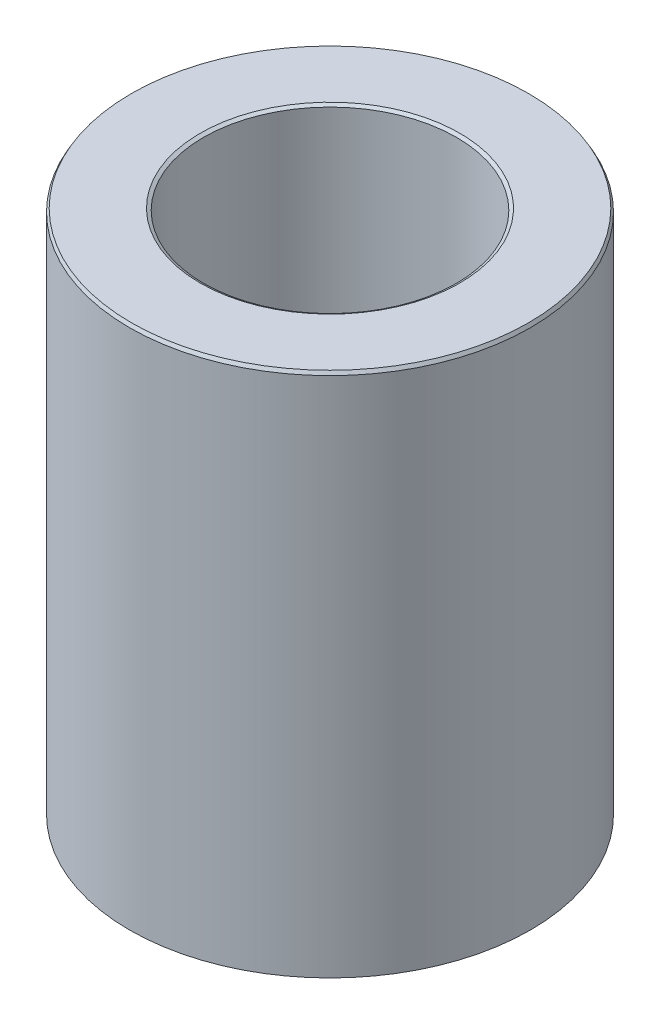
ISO-10303-21;
HEADER;
FILE_DESCRIPTION(('STEP AP214'),'2;1');
FILE_NAME('part.step','',(''),(''),'','','');
FILE_SCHEMA(('AUTOMOTIVE_DESIGN { 1 0 10303 214 1 1 1 1 }'));
ENDSEC;
DATA;
#1=APPLICATION_CONTEXT('core data for automotive mechanical design processes');
#2=APPLICATION_PROTOCOL_DEFINITION('international standard','automotive_design',2000,#1);
#3=PRODUCT_CONTEXT('',#1,'mechanical');
#4=PRODUCT('Part','Part','',(#3));
#5=PRODUCT_RELATED_PRODUCT_CATEGORY('part','',(#4));
#6=PRODUCT_DEFINITION_FORMATION('','',#4);
#7=PRODUCT_DEFINITION_CONTEXT('part definition',#1,'design');
#8=PRODUCT_DEFINITION('design','',#6,#7);
#9=PRODUCT_DEFINITION_SHAPE('','',#8);
#10=(LENGTH_UNIT() NAMED_UNIT(*) SI_UNIT(.MILLI.,.METRE.));
#11=(NAMED_UNIT(*) PLANE_ANGLE_UNIT() SI_UNIT($,.RADIAN.));
#12=(NAMED_UNIT(*) SI_UNIT($,.STERADIAN.) SOLID_ANGLE_UNIT());
#13=UNCERTAINTY_MEASURE_WITH_UNIT(LENGTH_MEASURE(1.E-05),#10,'distance_accuracy_value','');
#14=(GEOMETRIC_REPRESENTATION_CONTEXT(3) GLOBAL_UNCERTAINTY_ASSIGNED_CONTEXT((#13)) GLOBAL_UNIT_ASSIGNED_CONTEXT((#10,
#11,#12)) REPRESENTATION_CONTEXT('',''));
#15=CARTESIAN_POINT('',(0.,0.,0.));
#16=DIRECTION('',(0.,0.,1.));
#17=DIRECTION('',(1.,0.,0.));
#18=AXIS2_PLACEMENT_3D('',#15,#16,#17);
#19=CARTESIAN_POINT('',(0.,39.4217318701252,0.));
#20=DIRECTION('',(0.,-1.,0.));
#21=DIRECTION('',(0.,0.,-1.));
#22=AXIS2_PLACEMENT_3D('',#19,#20,#21);
#23=CYLINDRICAL_SURFACE('',#22,15.);
#24=CARTESIAN_POINT('',(0.,0.141312824764483,0.));
#25=DIRECTION('',(0.,1.,0.));
#26=DIRECTION('',(0.,0.,1.));
#27=AXIS2_PLACEMENT_3D('',#24,#25,#26);
#28=CIRCLE('',#27,15.);
#29=CARTESIAN_POINT('',(0.,0.141312824764483,15.));
#30=VERTEX_POINT('',#29);
#31=EDGE_CURVE('E10',#30,#30,#28,.T.);
#32=ORIENTED_EDGE('',*,*,#31,.T.);
#33=EDGE_LOOP('',(#32));
#34=FACE_BOUND('',#33,.T.);
#35=CARTESIAN_POINT('',(0.,39.1738101533161,0.));
#36=DIRECTION('',(0.,1.,0.));
#37=DIRECTION('',(0.,0.,1.));
#38=AXIS2_PLACEMENT_3D('',#35,#36,#37);
#39=CIRCLE('',#38,15.);
#40=CARTESIAN_POINT('',(0.,39.1738101533161,15.));
#41=VERTEX_POINT('',#40);
#42=EDGE_CURVE('E50',#41,#41,#39,.F.);
#43=ORIENTED_EDGE('',*,*,#42,.T.);
#44=EDGE_LOOP('',(#43));
#45=FACE_BOUND('',#44,.T.);
#46=ADVANCED_FACE('F39',(#34,#45),#23,.T.);
#47=CARTESIAN_POINT('',(0.,39.4217318701252,0.));
#48=DIRECTION('',(0.,1.,0.));
#49=DIRECTION('',(0.,0.,1.));
#50=AXIS2_PLACEMENT_3D('',#47,#48,#49);
#51=PLANE('',#50);
#52=CARTESIAN_POINT('',(0.,39.4217318701252,0.));
#53=DIRECTION('',(0.,1.,0.));
#54=DIRECTION('',(0.,0.,1.));
#55=AXIS2_PLACEMENT_3D('',#52,#53,#54);
#56=CIRCLE('',#55,9.71163303518275);
#57=CARTESIAN_POINT('',(0.,39.4217318701252,9.71163303518275));
#58=VERTEX_POINT('',#57);
#59=EDGE_CURVE('E58',#58,#58,#56,.F.);
#60=ORIENTED_EDGE('',*,*,#59,.T.);
#61=EDGE_LOOP('',(#60));
#62=FACE_BOUND('',#61,.T.);
#63=CARTESIAN_POINT('',(0.,39.4217318701252,0.));
#64=DIRECTION('',(0.,1.,0.));
#65=DIRECTION('',(0.,0.,1.));
#66=AXIS2_PLACEMENT_3D('',#63,#64,#65);
#67=CIRCLE('',#66,14.8586871752355);
#68=CARTESIAN_POINT('',(0.,39.4217318701252,14.8586871752355));
#69=VERTEX_POINT('',#68);
#70=EDGE_CURVE('E61',#69,#69,#67,.T.);
#71=ORIENTED_EDGE('',*,*,#70,.T.);
#72=EDGE_LOOP('',(#71));
#73=FACE_BOUND('',#72,.T.);
#74=ADVANCED_FACE('F88',(#62,#73),#51,.T.);
#75=CARTESIAN_POINT('',(0.,0.,0.));
#76=DIRECTION('',(0.,1.,0.));
#77=DIRECTION('',(0.,0.,1.));
#78=AXIS2_PLACEMENT_3D('',#75,#76,#77);
#79=PLANE('',#78);
#80=CARTESIAN_POINT('',(0.,0.,0.));
#81=DIRECTION('',(0.,1.,0.));
#82=DIRECTION('',(0.,0.,1.));
#83=AXIS2_PLACEMENT_3D('',#80,#81,#82);
#84=CIRCLE('',#83,9.60502414313814);
#85=CARTESIAN_POINT('',(0.,0.,9.60502414313814));
#86=VERTEX_POINT('',#85);
#87=EDGE_CURVE('E51',#86,#86,#84,.T.);
#88=ORIENTED_EDGE('',*,*,#87,.T.);
#89=EDGE_LOOP('',(#88));
#90=FACE_BOUND('',#89,.T.);
#91=CARTESIAN_POINT('',(0.,0.,0.));
#92=DIRECTION('',(0.,1.,0.));
#93=DIRECTION('',(0.,0.,1.));
#94=AXIS2_PLACEMENT_3D('',#91,#92,#93);
#95=CIRCLE('',#94,14.7520782831909);
#96=CARTESIAN_POINT('',(0.,0.,14.7520782831909));
#97=VERTEX_POINT('',#96);
#98=EDGE_CURVE('E54',#97,#97,#95,.F.);
#99=ORIENTED_EDGE('',*,*,#98,.T.);
#100=EDGE_LOOP('',(#99));
#101=FACE_BOUND('',#100,.T.);
#102=ADVANCED_FACE('F83',(#90,#101),#79,.F.);
#103=CARTESIAN_POINT('',(0.,39.4217318701252,0.));
#104=DIRECTION('',(0.,-1.,0.));
#105=DIRECTION('',(0.,0.,-1.));
#106=AXIS2_PLACEMENT_3D('',#103,#104,#105);
#107=CYLINDRICAL_SURFACE('',#106,9.46371131837366);
#108=CARTESIAN_POINT('',(0.,39.2804190453608,0.));
#109=DIRECTION('',(0.,1.,0.));
#110=DIRECTION('',(0.,0.,1.));
#111=AXIS2_PLACEMENT_3D('',#108,#109,#110);
#112=CIRCLE('',#111,9.46371131837366);
#113=CARTESIAN_POINT('',(0.,39.2804190453608,9.46371131837366));
#114=VERTEX_POINT('',#113);
#115=EDGE_CURVE('E67',#114,#114,#112,.T.);
#116=ORIENTED_EDGE('',*,*,#115,.T.);
#117=EDGE_LOOP('',(#116));
#118=FACE_BOUND('',#117,.T.);
#119=CARTESIAN_POINT('',(0.,0.247921716809096,0.));
#120=DIRECTION('',(0.,1.,0.));
#121=DIRECTION('',(0.,0.,1.));
#122=AXIS2_PLACEMENT_3D('',#119,#120,#121);
#123=CIRCLE('',#122,9.46371131837366);
#124=CARTESIAN_POINT('',(0.,0.247921716809096,9.46371131837366));
#125=VERTEX_POINT('',#124);
#126=EDGE_CURVE('E69',#125,#125,#123,.F.);
#127=ORIENTED_EDGE('',*,*,#126,.T.);
#128=EDGE_LOOP('',(#127));
#129=FACE_BOUND('',#128,.T.);
#130=ADVANCED_FACE('F71',(#118,#129),#107,.F.);
#131=CARTESIAN_POINT('',(0.,39.2804190453608,0.));
#132=DIRECTION('',(0.,1.,0.));
#133=DIRECTION('',(0.,0.,1.));
#134=AXIS2_PLACEMENT_3D('',#131,#132,#133);
#135=CONICAL_SURFACE('',#134,9.46371131837366,1.05273557322321);
#136=ORIENTED_EDGE('',*,*,#59,.F.);
#137=EDGE_LOOP('',(#136));
#138=FACE_BOUND('',#137,.T.);
#139=ORIENTED_EDGE('',*,*,#115,.F.);
#140=EDGE_LOOP('',(#139));
#141=FACE_BOUND('',#140,.T.);
#142=ADVANCED_FACE('F77',(#138,#141),#135,.F.);
#143=CARTESIAN_POINT('',(0.,0.,0.));
#144=DIRECTION('',(0.,-1.,0.));
#145=DIRECTION('',(0.,0.,-1.));
#146=AXIS2_PLACEMENT_3D('',#143,#144,#145);
#147=CONICAL_SURFACE('',#146,9.60502414313814,0.518060753571667);
#148=ORIENTED_EDGE('',*,*,#126,.F.);
#149=EDGE_LOOP('',(#148));
#150=FACE_BOUND('',#149,.T.);
#151=ORIENTED_EDGE('',*,*,#87,.F.);
#152=EDGE_LOOP('',(#151));
#153=FACE_BOUND('',#152,.T.);
#154=ADVANCED_FACE('F73',(#150,#153),#147,.F.);
#155=CARTESIAN_POINT('',(0.,0.141312824764483,0.));
#156=DIRECTION('',(0.,1.,0.));
#157=DIRECTION('',(0.,0.,1.));
#158=AXIS2_PLACEMENT_3D('',#155,#156,#157);
#159=CONICAL_SURFACE('',#158,15.,1.05273557322322);
#160=ORIENTED_EDGE('',*,*,#98,.F.);
#161=EDGE_LOOP('',(#160));
#162=FACE_BOUND('',#161,.T.);
#163=ORIENTED_EDGE('',*,*,#31,.F.);
#164=EDGE_LOOP('',(#163));
#165=FACE_BOUND('',#164,.T.);
#166=ADVANCED_FACE('F76',(#162,#165),#159,.T.);
#167=CARTESIAN_POINT('',(0.,39.4217318701252,0.));
#168=DIRECTION('',(0.,-1.,0.));
#169=DIRECTION('',(0.,0.,-1.));
#170=AXIS2_PLACEMENT_3D('',#167,#168,#169);
#171=CONICAL_SURFACE('',#170,14.8586871752355,0.51806075357168);
#172=ORIENTED_EDGE('',*,*,#42,.F.);
#173=EDGE_LOOP('',(#172));
#174=FACE_BOUND('',#173,.T.);
#175=ORIENTED_EDGE('',*,*,#70,.F.);
#176=EDGE_LOOP('',(#175));
#177=FACE_BOUND('',#176,.T.);
#178=ADVANCED_FACE('F45',(#174,#177),#171,.T.);
#179=CLOSED_SHELL('',(#46,#74,#102,#130,#142,#154,#166,#178));
#180=MANIFOLD_SOLID_BREP('B2',#179);
#181=ADVANCED_BREP_SHAPE_REPRESENTATION('',(#18,#180),#14);
#182=SHAPE_DEFINITION_REPRESENTATION(#9,#181);
ENDSEC;
END-ISO-10303-21;
